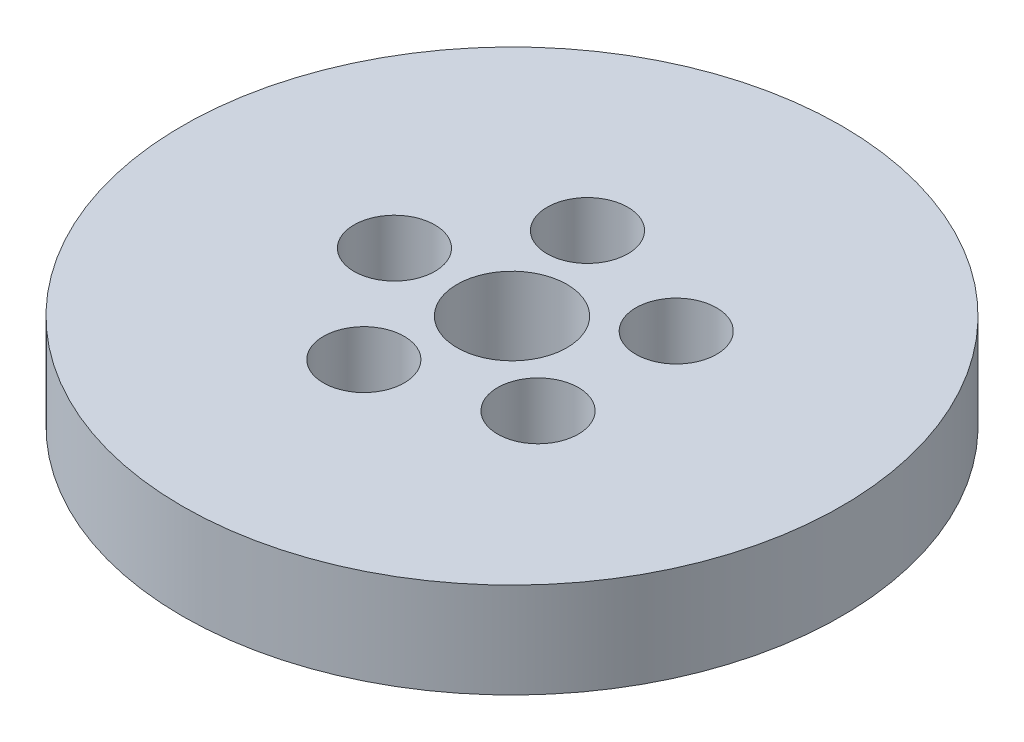
ISO-10303-21;
HEADER;
FILE_DESCRIPTION(('STEP AP214'),'2;1');
FILE_NAME('part.step','',(''),(''),'','','');
FILE_SCHEMA(('AUTOMOTIVE_DESIGN { 1 0 10303 214 1 1 1 1 }'));
ENDSEC;
DATA;
#1=APPLICATION_CONTEXT('core data for automotive mechanical design processes');
#2=APPLICATION_PROTOCOL_DEFINITION('international standard','automotive_design',2000,#1);
#3=PRODUCT_CONTEXT('',#1,'mechanical');
#4=PRODUCT('Part','Part','',(#3));
#5=PRODUCT_RELATED_PRODUCT_CATEGORY('part','',(#4));
#6=PRODUCT_DEFINITION_FORMATION('','',#4);
#7=PRODUCT_DEFINITION_CONTEXT('part definition',#1,'design');
#8=PRODUCT_DEFINITION('design','',#6,#7);
#9=PRODUCT_DEFINITION_SHAPE('','',#8);
#10=(LENGTH_UNIT() NAMED_UNIT(*) SI_UNIT(.MILLI.,.METRE.));
#11=(NAMED_UNIT(*) PLANE_ANGLE_UNIT() SI_UNIT($,.RADIAN.));
#12=(NAMED_UNIT(*) SI_UNIT($,.STERADIAN.) SOLID_ANGLE_UNIT());
#13=UNCERTAINTY_MEASURE_WITH_UNIT(LENGTH_MEASURE(1.E-05),#10,'distance_accuracy_value','');
#14=(GEOMETRIC_REPRESENTATION_CONTEXT(3) GLOBAL_UNCERTAINTY_ASSIGNED_CONTEXT((#13)) GLOBAL_UNIT_ASSIGNED_CONTEXT((#10,
#11,#12)) REPRESENTATION_CONTEXT('',''));
#15=CARTESIAN_POINT('',(0.,0.,0.));
#16=DIRECTION('',(0.,0.,1.));
#17=DIRECTION('',(1.,0.,0.));
#18=AXIS2_PLACEMENT_3D('',#15,#16,#17);
#19=CARTESIAN_POINT('',(0.,13.,0.));
#20=DIRECTION('',(0.,-1.,0.));
#21=DIRECTION('',(0.,0.,-1.));
#22=AXIS2_PLACEMENT_3D('',#19,#20,#21);
#23=CYLINDRICAL_SURFACE('',#22,45.);
#24=CARTESIAN_POINT('',(0.,13.,0.));
#25=DIRECTION('',(0.,1.,0.));
#26=DIRECTION('',(0.,0.,1.));
#27=AXIS2_PLACEMENT_3D('',#24,#25,#26);
#28=CIRCLE('',#27,45.);
#29=CARTESIAN_POINT('',(0.,13.,-45.));
#30=VERTEX_POINT('',#29);
#31=EDGE_CURVE('E10',#30,#30,#28,.T.);
#32=CARTESIAN_POINT('',(0.,0.,0.));
#33=DIRECTION('',(0.,1.,0.));
#34=DIRECTION('',(0.,0.,1.));
#35=AXIS2_PLACEMENT_3D('',#32,#33,#34);
#36=CIRCLE('',#35,45.);
#37=CARTESIAN_POINT('',(0.,0.,-45.));
#38=VERTEX_POINT('',#37);
#39=EDGE_CURVE('E37',#38,#38,#36,.T.);
#40=CARTESIAN_POINT('',(0.,13.,-45.));
#41=CARTESIAN_POINT('',(0.,12.8645833333333,-45.));
#42=CARTESIAN_POINT('',(0.,12.7291666666667,-45.));
#43=CARTESIAN_POINT('',(0.,12.4583333333333,-45.));
#44=CARTESIAN_POINT('',(0.,12.3229166666667,-45.));
#45=CARTESIAN_POINT('',(0.,12.0520833333333,-45.));
#46=CARTESIAN_POINT('',(0.,11.9166666666667,-45.));
#47=CARTESIAN_POINT('',(0.,11.6458333333333,-45.));
#48=CARTESIAN_POINT('',(0.,11.5104166666667,-45.));
#49=CARTESIAN_POINT('',(0.,11.2395833333333,-45.));
#50=CARTESIAN_POINT('',(0.,11.1041666666667,-45.));
#51=CARTESIAN_POINT('',(0.,10.8333333333333,-45.));
#52=CARTESIAN_POINT('',(0.,10.6979166666667,-45.));
#53=CARTESIAN_POINT('',(0.,10.4270833333333,-45.));
#54=CARTESIAN_POINT('',(0.,10.2916666666667,-45.));
#55=CARTESIAN_POINT('',(0.,10.0208333333333,-45.));
#56=CARTESIAN_POINT('',(0.,9.88541666666667,-45.));
#57=CARTESIAN_POINT('',(0.,9.61458333333333,-45.));
#58=CARTESIAN_POINT('',(0.,9.47916666666667,-45.));
#59=CARTESIAN_POINT('',(0.,9.20833333333333,-45.));
#60=CARTESIAN_POINT('',(0.,9.07291666666666,-45.));
#61=CARTESIAN_POINT('',(0.,8.80208333333333,-45.));
#62=CARTESIAN_POINT('',(0.,8.66666666666667,-45.));
#63=CARTESIAN_POINT('',(0.,8.39583333333333,-45.));
#64=CARTESIAN_POINT('',(0.,8.26041666666667,-45.));
#65=CARTESIAN_POINT('',(0.,7.98958333333333,-45.));
#66=CARTESIAN_POINT('',(0.,7.85416666666667,-45.));
#67=CARTESIAN_POINT('',(0.,7.58333333333333,-45.));
#68=CARTESIAN_POINT('',(0.,7.44791666666667,-45.));
#69=CARTESIAN_POINT('',(0.,7.17708333333333,-45.));
#70=CARTESIAN_POINT('',(0.,7.04166666666667,-45.));
#71=CARTESIAN_POINT('',(0.,6.77083333333333,-45.));
#72=CARTESIAN_POINT('',(0.,6.63541666666667,-45.));
#73=CARTESIAN_POINT('',(0.,6.36458333333333,-45.));
#74=CARTESIAN_POINT('',(0.,6.22916666666667,-45.));
#75=CARTESIAN_POINT('',(0.,5.95833333333333,-45.));
#76=CARTESIAN_POINT('',(0.,5.82291666666667,-45.));
#77=CARTESIAN_POINT('',(0.,5.55208333333333,-45.));
#78=CARTESIAN_POINT('',(0.,5.41666666666667,-45.));
#79=CARTESIAN_POINT('',(0.,5.14583333333333,-45.));
#80=CARTESIAN_POINT('',(0.,5.01041666666667,-45.));
#81=CARTESIAN_POINT('',(0.,4.73958333333333,-45.));
#82=CARTESIAN_POINT('',(0.,4.60416666666667,-45.));
#83=CARTESIAN_POINT('',(0.,4.33333333333333,-45.));
#84=CARTESIAN_POINT('',(0.,4.19791666666667,-45.));
#85=CARTESIAN_POINT('',(0.,3.92708333333333,-45.));
#86=CARTESIAN_POINT('',(0.,3.79166666666667,-45.));
#87=CARTESIAN_POINT('',(0.,3.52083333333333,-45.));
#88=CARTESIAN_POINT('',(0.,3.38541666666667,-45.));
#89=CARTESIAN_POINT('',(0.,3.11458333333333,-45.));
#90=CARTESIAN_POINT('',(0.,2.97916666666667,-45.));
#91=CARTESIAN_POINT('',(0.,2.70833333333333,-45.));
#92=CARTESIAN_POINT('',(0.,2.57291666666667,-45.));
#93=CARTESIAN_POINT('',(0.,2.30208333333333,-45.));
#94=CARTESIAN_POINT('',(0.,2.16666666666667,-45.));
#95=CARTESIAN_POINT('',(0.,1.89583333333333,-45.));
#96=CARTESIAN_POINT('',(0.,1.76041666666667,-45.));
#97=CARTESIAN_POINT('',(0.,1.48958333333333,-45.));
#98=CARTESIAN_POINT('',(0.,1.35416666666667,-45.));
#99=CARTESIAN_POINT('',(0.,1.08333333333333,-45.));
#100=CARTESIAN_POINT('',(0.,0.947916666666667,-45.));
#101=CARTESIAN_POINT('',(0.,0.677083333333334,-45.));
#102=CARTESIAN_POINT('',(0.,0.541666666666667,-45.));
#103=CARTESIAN_POINT('',(0.,0.270833333333334,-45.));
#104=CARTESIAN_POINT('',(0.,0.135416666666667,-45.));
#105=CARTESIAN_POINT('',(0.,0.,-45.));
#106=B_SPLINE_CURVE_WITH_KNOTS('',3,(#40,#41,#42,#43,#44,#45,#46,#47,#48,#49,#50,#51,#52,#53,
#54,#55,#56,#57,#58,#59,#60,#61,#62,#63,#64,#65,#66,#67,#68,#69,#70,#71,#72,#73,#74,#75,#76,#77,
#78,#79,#80,#81,#82,#83,#84,#85,#86,#87,#88,#89,#90,#91,#92,#93,#94,#95,#96,#97,#98,#99,#100,
#101,#102,#103,#104,#105),.UNSPECIFIED.,.F.,.F.,(4,2,2,2,2,2,2,2,2,2,2,2,2,2,2,2,2,2,2,2,2,2,2,
2,2,2,2,2,2,2,2,2,4),(0.,0.40625,0.812500000000001,1.21875,1.625,2.03125,2.4375,2.84375,3.25,
3.65625,4.0625,4.46875,4.875,5.28125,5.6875,6.09375,6.5,6.90625,7.3125,7.71875,8.125,8.53125,
8.9375,9.34375,9.75,10.15625,10.5625,10.96875,11.375,11.78125,12.1875,12.59375,13.),.UNSPECIFIED.);
#107=EDGE_CURVE('BSEAM40',#30,#38,#106,.T.);
#108=ORIENTED_EDGE('',*,*,#31,.F.);
#109=ORIENTED_EDGE('',*,*,#39,.T.);
#110=ORIENTED_EDGE('',*,*,#107,.T.);
#111=ORIENTED_EDGE('',*,*,#107,.F.);
#112=EDGE_LOOP('',(#108,#110,#109,#111));
#113=FACE_BOUND('',#112,.T.);
#114=ADVANCED_FACE('F40',(#113),#23,.T.);
#115=CARTESIAN_POINT('',(0.,13.,0.));
#116=DIRECTION('',(0.,1.,0.));
#117=DIRECTION('',(0.,0.,1.));
#118=AXIS2_PLACEMENT_3D('',#115,#116,#117);
#119=PLANE('',#118);
#120=CARTESIAN_POINT('',(-4.96089529885948,13.,-15.2680657909493));
#121=DIRECTION('',(0.,1.,0.));
#122=DIRECTION('',(-0.95105651629515,0.,0.309016994374958));
#123=AXIS2_PLACEMENT_3D('',#120,#121,#122);
#124=CIRCLE('',#123,5.51474949676527);
#125=CARTESIAN_POINT('',(-10.2057337434935,13.,-13.5639144767281));
#126=VERTEX_POINT('',#125);
#127=EDGE_CURVE('E70',#126,#126,#124,.T.);
#128=ORIENTED_EDGE('',*,*,#127,.F.);
#129=EDGE_LOOP('',(#128));
#130=FACE_BOUND('',#129,.T.);
#131=CARTESIAN_POINT('',(12.9877925070432,13.,-9.43618360127639));
#132=DIRECTION('',(0.,1.,0.));
#133=DIRECTION('',(-0.58778525229248,0.,-0.809016994374942));
#134=AXIS2_PLACEMENT_3D('',#131,#132,#133);
#135=CIRCLE('',#134,5.51474949676527);
#136=CARTESIAN_POINT('',(9.74630408275715,13.,-13.8977096638802));
#137=VERTEX_POINT('',#136);
#138=EDGE_CURVE('E71',#137,#137,#135,.T.);
#139=ORIENTED_EDGE('',*,*,#138,.F.);
#140=EDGE_LOOP('',(#139));
#141=FACE_BOUND('',#140,.T.);
#142=CARTESIAN_POINT('',(12.9877925070433,13.,9.4361836012762));
#143=DIRECTION('',(0.,1.,0.));
#144=DIRECTION('',(0.587785252292469,0.,-0.809016994374951));
#145=AXIS2_PLACEMENT_3D('',#142,#143,#144);
#146=CIRCLE('',#145,5.51474949676527);
#147=CARTESIAN_POINT('',(16.2292809313292,13.,4.97465753867239));
#148=VERTEX_POINT('',#147);
#149=EDGE_CURVE('E78',#148,#148,#146,.T.);
#150=ORIENTED_EDGE('',*,*,#149,.F.);
#151=EDGE_LOOP('',(#150));
#152=FACE_BOUND('',#151,.T.);
#153=CARTESIAN_POINT('',(-4.96089529885927,13.,15.2680657909494));
#154=DIRECTION('',(0.,1.,0.));
#155=DIRECTION('',(0.951056516295155,0.,0.309016994374945));
#156=AXIS2_PLACEMENT_3D('',#153,#154,#155);
#157=CIRCLE('',#156,5.51474949676527);
#158=CARTESIAN_POINT('',(0.283943145774773,13.,16.9722171051706));
#159=VERTEX_POINT('',#158);
#160=EDGE_CURVE('E61',#159,#159,#157,.T.);
#161=ORIENTED_EDGE('',*,*,#160,.F.);
#162=EDGE_LOOP('',(#161));
#163=FACE_BOUND('',#162,.T.);
#164=CARTESIAN_POINT('',(-16.0537944163679,13.,0.));
#165=DIRECTION('',(0.,1.,0.));
#166=DIRECTION('',(0.,0.,1.));
#167=AXIS2_PLACEMENT_3D('',#164,#165,#166);
#168=CIRCLE('',#167,5.51474949676527);
#169=CARTESIAN_POINT('',(-16.0537944163679,13.,5.51474949676527));
#170=VERTEX_POINT('',#169);
#171=EDGE_CURVE('E54',#170,#170,#168,.T.);
#172=ORIENTED_EDGE('',*,*,#171,.F.);
#173=EDGE_LOOP('',(#172));
#174=FACE_BOUND('',#173,.T.);
#175=CARTESIAN_POINT('',(0.,13.,0.));
#176=DIRECTION('',(0.,1.,0.));
#177=DIRECTION('',(0.,0.,1.));
#178=AXIS2_PLACEMENT_3D('',#175,#176,#177);
#179=CIRCLE('',#178,7.5);
#180=CARTESIAN_POINT('',(0.,13.,-7.5));
#181=VERTEX_POINT('',#180);
#182=EDGE_CURVE('E50',#181,#181,#179,.T.);
#183=ORIENTED_EDGE('',*,*,#182,.F.);
#184=EDGE_LOOP('',(#183));
#185=FACE_BOUND('',#184,.T.);
#186=ORIENTED_EDGE('',*,*,#31,.T.);
#187=EDGE_LOOP('',(#186));
#188=FACE_BOUND('',#187,.T.);
#189=ADVANCED_FACE('F94',(#130,#141,#152,#163,#174,#185,#188),#119,.T.);
#190=CARTESIAN_POINT('',(0.,0.,0.));
#191=DIRECTION('',(0.,1.,0.));
#192=DIRECTION('',(0.,0.,1.));
#193=AXIS2_PLACEMENT_3D('',#190,#191,#192);
#194=PLANE('',#193);
#195=CARTESIAN_POINT('',(0.,0.,0.));
#196=DIRECTION('',(0.,1.,0.));
#197=DIRECTION('',(0.,0.,1.));
#198=AXIS2_PLACEMENT_3D('',#195,#196,#197);
#199=CIRCLE('',#198,7.5);
#200=CARTESIAN_POINT('',(0.,0.,-7.5));
#201=VERTEX_POINT('',#200);
#202=EDGE_CURVE('E47',#201,#201,#199,.T.);
#203=ORIENTED_EDGE('',*,*,#202,.T.);
#204=EDGE_LOOP('',(#203));
#205=FACE_BOUND('',#204,.T.);
#206=ORIENTED_EDGE('',*,*,#39,.F.);
#207=EDGE_LOOP('',(#206));
#208=FACE_BOUND('',#207,.T.);
#209=ADVANCED_FACE('F100',(#205,#208),#194,.F.);
#210=CARTESIAN_POINT('',(0.,13.,0.));
#211=DIRECTION('',(0.,-1.,0.));
#212=DIRECTION('',(0.,0.,-1.));
#213=AXIS2_PLACEMENT_3D('',#210,#211,#212);
#214=CYLINDRICAL_SURFACE('',#213,7.5);
#215=CARTESIAN_POINT('',(0.,13.,-7.5));
#216=CARTESIAN_POINT('',(0.,12.8645833333333,-7.5));
#217=CARTESIAN_POINT('',(0.,12.7291666666667,-7.5));
#218=CARTESIAN_POINT('',(0.,12.4583333333333,-7.5));
#219=CARTESIAN_POINT('',(0.,12.3229166666667,-7.5));
#220=CARTESIAN_POINT('',(0.,12.0520833333333,-7.5));
#221=CARTESIAN_POINT('',(0.,11.9166666666667,-7.5));
#222=CARTESIAN_POINT('',(0.,11.6458333333333,-7.5));
#223=CARTESIAN_POINT('',(0.,11.5104166666667,-7.5));
#224=CARTESIAN_POINT('',(0.,11.2395833333333,-7.5));
#225=CARTESIAN_POINT('',(0.,11.1041666666667,-7.5));
#226=CARTESIAN_POINT('',(0.,10.8333333333333,-7.5));
#227=CARTESIAN_POINT('',(0.,10.6979166666667,-7.5));
#228=CARTESIAN_POINT('',(0.,10.4270833333333,-7.5));
#229=CARTESIAN_POINT('',(0.,10.2916666666667,-7.5));
#230=CARTESIAN_POINT('',(0.,10.0208333333333,-7.5));
#231=CARTESIAN_POINT('',(0.,9.88541666666667,-7.5));
#232=CARTESIAN_POINT('',(0.,9.61458333333333,-7.5));
#233=CARTESIAN_POINT('',(0.,9.47916666666667,-7.5));
#234=CARTESIAN_POINT('',(0.,9.20833333333333,-7.5));
#235=CARTESIAN_POINT('',(0.,9.07291666666666,-7.5));
#236=CARTESIAN_POINT('',(0.,8.80208333333333,-7.5));
#237=CARTESIAN_POINT('',(0.,8.66666666666667,-7.5));
#238=CARTESIAN_POINT('',(0.,8.39583333333333,-7.5));
#239=CARTESIAN_POINT('',(0.,8.26041666666667,-7.5));
#240=CARTESIAN_POINT('',(0.,7.98958333333333,-7.5));
#241=CARTESIAN_POINT('',(0.,7.85416666666667,-7.5));
#242=CARTESIAN_POINT('',(0.,7.58333333333333,-7.5));
#243=CARTESIAN_POINT('',(0.,7.44791666666667,-7.5));
#244=CARTESIAN_POINT('',(0.,7.17708333333333,-7.5));
#245=CARTESIAN_POINT('',(0.,7.04166666666667,-7.5));
#246=CARTESIAN_POINT('',(0.,6.77083333333333,-7.5));
#247=CARTESIAN_POINT('',(0.,6.63541666666667,-7.5));
#248=CARTESIAN_POINT('',(0.,6.36458333333333,-7.5));
#249=CARTESIAN_POINT('',(0.,6.22916666666667,-7.5));
#250=CARTESIAN_POINT('',(0.,5.95833333333333,-7.5));
#251=CARTESIAN_POINT('',(0.,5.82291666666667,-7.5));
#252=CARTESIAN_POINT('',(0.,5.55208333333333,-7.5));
#253=CARTESIAN_POINT('',(0.,5.41666666666667,-7.5));
#254=CARTESIAN_POINT('',(0.,5.14583333333333,-7.5));
#255=CARTESIAN_POINT('',(0.,5.01041666666667,-7.5));
#256=CARTESIAN_POINT('',(0.,4.73958333333333,-7.5));
#257=CARTESIAN_POINT('',(0.,4.60416666666667,-7.5));
#258=CARTESIAN_POINT('',(0.,4.33333333333333,-7.5));
#259=CARTESIAN_POINT('',(0.,4.19791666666667,-7.5));
#260=CARTESIAN_POINT('',(0.,3.92708333333333,-7.5));
#261=CARTESIAN_POINT('',(0.,3.79166666666667,-7.5));
#262=CARTESIAN_POINT('',(0.,3.52083333333333,-7.5));
#263=CARTESIAN_POINT('',(0.,3.38541666666667,-7.5));
#264=CARTESIAN_POINT('',(0.,3.11458333333333,-7.5));
#265=CARTESIAN_POINT('',(0.,2.97916666666667,-7.5));
#266=CARTESIAN_POINT('',(0.,2.70833333333333,-7.5));
#267=CARTESIAN_POINT('',(0.,2.57291666666667,-7.5));
#268=CARTESIAN_POINT('',(0.,2.30208333333333,-7.5));
#269=CARTESIAN_POINT('',(0.,2.16666666666667,-7.5));
#270=CARTESIAN_POINT('',(0.,1.89583333333333,-7.5));
#271=CARTESIAN_POINT('',(0.,1.76041666666667,-7.5));
#272=CARTESIAN_POINT('',(0.,1.48958333333333,-7.5));
#273=CARTESIAN_POINT('',(0.,1.35416666666667,-7.5));
#274=CARTESIAN_POINT('',(0.,1.08333333333333,-7.5));
#275=CARTESIAN_POINT('',(0.,0.947916666666667,-7.5));
#276=CARTESIAN_POINT('',(0.,0.677083333333334,-7.5));
#277=CARTESIAN_POINT('',(0.,0.541666666666667,-7.5));
#278=CARTESIAN_POINT('',(0.,0.270833333333334,-7.5));
#279=CARTESIAN_POINT('',(0.,0.135416666666667,-7.5));
#280=CARTESIAN_POINT('',(0.,0.,-7.5));
#281=B_SPLINE_CURVE_WITH_KNOTS('',3,(#215,#216,#217,#218,#219,#220,#221,#222,#223,#224,#225,
#226,#227,#228,#229,#230,#231,#232,#233,#234,#235,#236,#237,#238,#239,#240,#241,#242,#243,#244,
#245,#246,#247,#248,#249,#250,#251,#252,#253,#254,#255,#256,#257,#258,#259,#260,#261,#262,#263,
#264,#265,#266,#267,#268,#269,#270,#271,#272,#273,#274,#275,#276,#277,#278,#279,#280),
.UNSPECIFIED.,.F.,.F.,(4,2,2,2,2,2,2,2,2,2,2,2,2,2,2,2,2,2,2,2,2,2,2,2,2,2,2,2,2,2,2,2,4),(0.,
0.40625,0.812500000000001,1.21875,1.625,2.03125,2.4375,2.84375,3.25,3.65625,4.0625,4.46875,
4.875,5.28125,5.6875,6.09375,6.5,6.90625,7.3125,7.71875,8.125,8.53125,8.9375,9.34375,9.75,
10.15625,10.5625,10.96875,11.375,11.78125,12.1875,12.59375,13.),.UNSPECIFIED.);
#282=EDGE_CURVE('BSEAM106',#181,#201,#281,.T.);
#283=ORIENTED_EDGE('',*,*,#182,.T.);
#284=ORIENTED_EDGE('',*,*,#202,.F.);
#285=ORIENTED_EDGE('',*,*,#282,.T.);
#286=ORIENTED_EDGE('',*,*,#282,.F.);
#287=EDGE_LOOP('',(#283,#285,#284,#286));
#288=FACE_BOUND('',#287,.T.);
#289=ADVANCED_FACE('F106',(#288),#214,.F.);
#290=CARTESIAN_POINT('',(-16.0537944163679,4.88274735684176,0.));
#291=DIRECTION('',(0.,1.,0.));
#292=DIRECTION('',(0.,0.,1.));
#293=AXIS2_PLACEMENT_3D('',#290,#291,#292);
#294=CYLINDRICAL_SURFACE('',#293,5.51474949676527);
#295=CARTESIAN_POINT('',(-16.0537944163679,4.88274735684176,0.));
#296=DIRECTION('',(0.,1.,0.));
#297=DIRECTION('',(0.,0.,1.));
#298=AXIS2_PLACEMENT_3D('',#295,#296,#297);
#299=CIRCLE('',#298,5.51474949676527);
#300=CARTESIAN_POINT('',(-16.0537944163679,4.88274735684176,5.51474949676527));
#301=VERTEX_POINT('',#300);
#302=EDGE_CURVE('E55',#301,#301,#299,.T.);
#303=ORIENTED_EDGE('',*,*,#302,.F.);
#304=EDGE_LOOP('',(#303));
#305=FACE_BOUND('',#304,.T.);
#306=ORIENTED_EDGE('',*,*,#171,.T.);
#307=EDGE_LOOP('',(#306));
#308=FACE_BOUND('',#307,.T.);
#309=ADVANCED_FACE('F108',(#305,#308),#294,.F.);
#310=CARTESIAN_POINT('',(-16.0537944163679,4.88274735684176,0.));
#311=DIRECTION('',(0.,1.,0.));
#312=DIRECTION('',(0.,0.,1.));
#313=AXIS2_PLACEMENT_3D('',#310,#311,#312);
#314=PLANE('',#313);
#315=ORIENTED_EDGE('',*,*,#302,.T.);
#316=EDGE_LOOP('',(#315));
#317=FACE_BOUND('',#316,.T.);
#318=ADVANCED_FACE('F138',(#317),#314,.T.);
#319=CARTESIAN_POINT('',(-4.96089529885927,4.88274735684176,15.2680657909494));
#320=DIRECTION('',(0.,1.,0.));
#321=DIRECTION('',(0.,0.,1.));
#322=AXIS2_PLACEMENT_3D('',#319,#320,#321);
#323=CYLINDRICAL_SURFACE('',#322,5.51474949676527);
#324=CARTESIAN_POINT('',(-4.96089529885927,4.88274735684176,15.2680657909494));
#325=DIRECTION('',(0.,1.,0.));
#326=DIRECTION('',(0.951056516295155,0.,0.309016994374945));
#327=AXIS2_PLACEMENT_3D('',#324,#325,#326);
#328=CIRCLE('',#327,5.51474949676527);
#329=CARTESIAN_POINT('',(0.283943145774773,4.88274735684176,16.9722171051706));
#330=VERTEX_POINT('',#329);
#331=EDGE_CURVE('E59',#330,#330,#328,.T.);
#332=ORIENTED_EDGE('',*,*,#331,.F.);
#333=EDGE_LOOP('',(#332));
#334=FACE_BOUND('',#333,.T.);
#335=ORIENTED_EDGE('',*,*,#160,.T.);
#336=EDGE_LOOP('',(#335));
#337=FACE_BOUND('',#336,.T.);
#338=ADVANCED_FACE('F150',(#334,#337),#323,.F.);
#339=CARTESIAN_POINT('',(-4.96089529885927,4.88274735684176,15.2680657909494));
#340=DIRECTION('',(0.,1.,0.));
#341=DIRECTION('',(0.951056516295155,0.,0.309016994374945));
#342=AXIS2_PLACEMENT_3D('',#339,#340,#341);
#343=PLANE('',#342);
#344=ORIENTED_EDGE('',*,*,#331,.T.);
#345=EDGE_LOOP('',(#344));
#346=FACE_BOUND('',#345,.T.);
#347=ADVANCED_FACE('F89',(#346),#343,.T.);
#348=CARTESIAN_POINT('',(12.9877925070433,4.88274735684176,9.4361836012762));
#349=DIRECTION('',(0.,1.,0.));
#350=DIRECTION('',(0.,0.,1.));
#351=AXIS2_PLACEMENT_3D('',#348,#349,#350);
#352=CYLINDRICAL_SURFACE('',#351,5.51474949676527);
#353=CARTESIAN_POINT('',(12.9877925070433,4.88274735684176,9.4361836012762));
#354=DIRECTION('',(0.,1.,0.));
#355=DIRECTION('',(0.587785252292469,0.,-0.809016994374951));
#356=AXIS2_PLACEMENT_3D('',#353,#354,#355);
#357=CIRCLE('',#356,5.51474949676527);
#358=CARTESIAN_POINT('',(16.2292809313292,4.88274735684176,4.97465753867239));
#359=VERTEX_POINT('',#358);
#360=EDGE_CURVE('E63',#359,#359,#357,.T.);
#361=ORIENTED_EDGE('',*,*,#360,.F.);
#362=EDGE_LOOP('',(#361));
#363=FACE_BOUND('',#362,.T.);
#364=ORIENTED_EDGE('',*,*,#149,.T.);
#365=EDGE_LOOP('',(#364));
#366=FACE_BOUND('',#365,.T.);
#367=ADVANCED_FACE('F87',(#363,#366),#352,.F.);
#368=CARTESIAN_POINT('',(12.9877925070433,4.88274735684176,9.4361836012762));
#369=DIRECTION('',(0.,1.,0.));
#370=DIRECTION('',(0.587785252292469,0.,-0.809016994374951));
#371=AXIS2_PLACEMENT_3D('',#368,#369,#370);
#372=PLANE('',#371);
#373=ORIENTED_EDGE('',*,*,#360,.T.);
#374=EDGE_LOOP('',(#373));
#375=FACE_BOUND('',#374,.T.);
#376=ADVANCED_FACE('F84',(#375),#372,.T.);
#377=CARTESIAN_POINT('',(12.9877925070432,4.88274735684176,-9.43618360127639));
#378=DIRECTION('',(0.,1.,0.));
#379=DIRECTION('',(0.,0.,1.));
#380=AXIS2_PLACEMENT_3D('',#377,#378,#379);
#381=CYLINDRICAL_SURFACE('',#380,5.51474949676527);
#382=CARTESIAN_POINT('',(12.9877925070432,4.88274735684176,-9.43618360127639));
#383=DIRECTION('',(0.,1.,0.));
#384=DIRECTION('',(-0.58778525229248,0.,-0.809016994374942));
#385=AXIS2_PLACEMENT_3D('',#382,#383,#384);
#386=CIRCLE('',#385,5.51474949676527);
#387=CARTESIAN_POINT('',(9.74630408275715,4.88274735684176,-13.8977096638802));
#388=VERTEX_POINT('',#387);
#389=EDGE_CURVE('E76',#388,#388,#386,.T.);
#390=ORIENTED_EDGE('',*,*,#389,.F.);
#391=EDGE_LOOP('',(#390));
#392=FACE_BOUND('',#391,.T.);
#393=ORIENTED_EDGE('',*,*,#138,.T.);
#394=EDGE_LOOP('',(#393));
#395=FACE_BOUND('',#394,.T.);
#396=ADVANCED_FACE('F185',(#392,#395),#381,.F.);
#397=CARTESIAN_POINT('',(12.9877925070432,4.88274735684176,-9.43618360127639));
#398=DIRECTION('',(0.,1.,0.));
#399=DIRECTION('',(-0.58778525229248,0.,-0.809016994374942));
#400=AXIS2_PLACEMENT_3D('',#397,#398,#399);
#401=PLANE('',#400);
#402=ORIENTED_EDGE('',*,*,#389,.T.);
#403=EDGE_LOOP('',(#402));
#404=FACE_BOUND('',#403,.T.);
#405=ADVANCED_FACE('F189',(#404),#401,.T.);
#406=CARTESIAN_POINT('',(-4.96089529885948,4.88274735684176,-15.2680657909493));
#407=DIRECTION('',(0.,1.,0.));
#408=DIRECTION('',(0.,0.,1.));
#409=AXIS2_PLACEMENT_3D('',#406,#407,#408);
#410=CYLINDRICAL_SURFACE('',#409,5.51474949676527);
#411=CARTESIAN_POINT('',(-4.96089529885948,4.88274735684176,-15.2680657909493));
#412=DIRECTION('',(0.,1.,0.));
#413=DIRECTION('',(-0.95105651629515,0.,0.309016994374958));
#414=AXIS2_PLACEMENT_3D('',#411,#412,#413);
#415=CIRCLE('',#414,5.51474949676527);
#416=CARTESIAN_POINT('',(-10.2057337434935,4.88274735684176,-13.5639144767281));
#417=VERTEX_POINT('',#416);
#418=EDGE_CURVE('E69',#417,#417,#415,.T.);
#419=ORIENTED_EDGE('',*,*,#418,.F.);
#420=EDGE_LOOP('',(#419));
#421=FACE_BOUND('',#420,.T.);
#422=ORIENTED_EDGE('',*,*,#127,.T.);
#423=EDGE_LOOP('',(#422));
#424=FACE_BOUND('',#423,.T.);
#425=ADVANCED_FACE('F200',(#421,#424),#410,.F.);
#426=CARTESIAN_POINT('',(-4.96089529885948,4.88274735684176,-15.2680657909493));
#427=DIRECTION('',(0.,1.,0.));
#428=DIRECTION('',(-0.95105651629515,0.,0.309016994374958));
#429=AXIS2_PLACEMENT_3D('',#426,#427,#428);
#430=PLANE('',#429);
#431=ORIENTED_EDGE('',*,*,#418,.T.);
#432=EDGE_LOOP('',(#431));
#433=FACE_BOUND('',#432,.T.);
#434=ADVANCED_FACE('F208',(#433),#430,.T.);
#435=CLOSED_SHELL('',(#114,#189,#209,#289,#309,#318,#338,#347,#367,#376,#396,#405,#425,#434));
#436=MANIFOLD_SOLID_BREP('B2',#435);
#437=ADVANCED_BREP_SHAPE_REPRESENTATION('',(#18,#436),#14);
#438=SHAPE_DEFINITION_REPRESENTATION(#9,#437);
ENDSEC;
END-ISO-10303-21;
